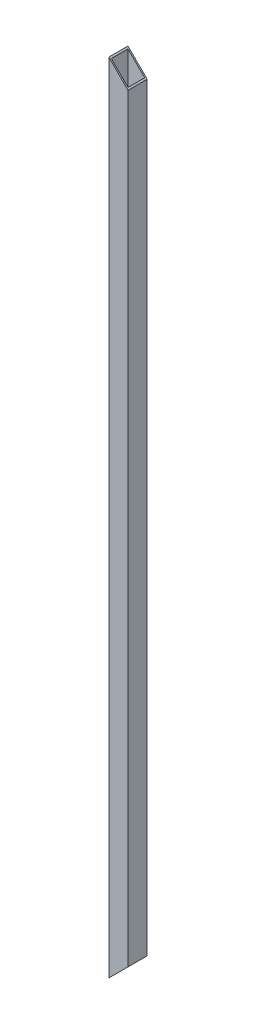
ISO-10303-21;
HEADER;
FILE_DESCRIPTION(('STEP AP214'),'2;1');
FILE_NAME('part.step','',(''),(''),'','','');
FILE_SCHEMA(('AUTOMOTIVE_DESIGN { 1 0 10303 214 1 1 1 1 }'));
ENDSEC;
DATA;
#1=APPLICATION_CONTEXT('core data for automotive mechanical design processes');
#2=APPLICATION_PROTOCOL_DEFINITION('international standard','automotive_design',2000,#1);
#3=PRODUCT_CONTEXT('',#1,'mechanical');
#4=PRODUCT('Part','Part','',(#3));
#5=PRODUCT_RELATED_PRODUCT_CATEGORY('part','',(#4));
#6=PRODUCT_DEFINITION_FORMATION('','',#4);
#7=PRODUCT_DEFINITION_CONTEXT('part definition',#1,'design');
#8=PRODUCT_DEFINITION('design','',#6,#7);
#9=PRODUCT_DEFINITION_SHAPE('','',#8);
#10=(LENGTH_UNIT() NAMED_UNIT(*) SI_UNIT(.MILLI.,.METRE.));
#11=(NAMED_UNIT(*) PLANE_ANGLE_UNIT() SI_UNIT($,.RADIAN.));
#12=(NAMED_UNIT(*) SI_UNIT($,.STERADIAN.) SOLID_ANGLE_UNIT());
#13=UNCERTAINTY_MEASURE_WITH_UNIT(LENGTH_MEASURE(1.E-05),#10,'distance_accuracy_value','');
#14=(GEOMETRIC_REPRESENTATION_CONTEXT(3) GLOBAL_UNCERTAINTY_ASSIGNED_CONTEXT((#13)) GLOBAL_UNIT_ASSIGNED_CONTEXT((#10,
#11,#12)) REPRESENTATION_CONTEXT('',''));
#15=CARTESIAN_POINT('',(0.,0.,0.));
#16=DIRECTION('',(0.,0.,1.));
#17=DIRECTION('',(1.,0.,0.));
#18=AXIS2_PLACEMENT_3D('',#15,#16,#17);
#19=CARTESIAN_POINT('',(19.,1580.,-19.));
#20=DIRECTION('',(1.,0.,0.));
#21=DIRECTION('',(0.,0.,-1.));
#22=AXIS2_PLACEMENT_3D('',#19,#20,#21);
#23=PLANE('',#22);
#24=DIRECTION('',(0.,0.,1.));
#25=VECTOR('',#24,1.);
#26=CARTESIAN_POINT('',(19.,1542.,-1561.91365988153));
#27=LINE('',#26,#25);
#28=CARTESIAN_POINT('',(19.,1542.,-19.));
#29=VERTEX_POINT('',#28);
#30=CARTESIAN_POINT('',(19.,1542.,19.));
#31=VERTEX_POINT('',#30);
#32=EDGE_CURVE('E97',#29,#31,#27,.T.);
#33=ORIENTED_EDGE('',*,*,#32,.T.);
#34=DIRECTION('',(0.,-1.,0.));
#35=VECTOR('',#34,1.);
#36=CARTESIAN_POINT('',(19.,1580.,19.));
#37=LINE('',#36,#35);
#38=CARTESIAN_POINT('',(19.,38.,19.));
#39=VERTEX_POINT('',#38);
#40=EDGE_CURVE('E95',#31,#39,#37,.T.);
#41=ORIENTED_EDGE('',*,*,#40,.T.);
#42=DIRECTION('',(0.,0.,1.));
#43=VECTOR('',#42,1.);
#44=CARTESIAN_POINT('',(19.,38.,-1561.91365988153));
#45=LINE('',#44,#43);
#46=CARTESIAN_POINT('',(19.,38.0000000000005,-19.));
#47=VERTEX_POINT('',#46);
#48=EDGE_CURVE('E137',#47,#39,#45,.T.);
#49=ORIENTED_EDGE('',*,*,#48,.F.);
#50=DIRECTION('',(0.,-1.,0.));
#51=VECTOR('',#50,1.);
#52=CARTESIAN_POINT('',(19.,1580.,-19.));
#53=LINE('',#52,#51);
#54=EDGE_CURVE('E85',#29,#47,#53,.T.);
#55=ORIENTED_EDGE('',*,*,#54,.F.);
#56=EDGE_LOOP('',(#33,#41,#49,#55));
#57=FACE_BOUND('',#56,.T.);
#58=ADVANCED_FACE('F17',(#57),#23,.T.);
#59=CARTESIAN_POINT('',(19.,1580.,19.));
#60=DIRECTION('',(0.,0.,1.));
#61=DIRECTION('',(1.,0.,0.));
#62=AXIS2_PLACEMENT_3D('',#59,#60,#61);
#63=PLANE('',#62);
#64=DIRECTION('',(0.707106781186547,-0.707106781186548,0.));
#65=VECTOR('',#64,1.);
#66=CARTESIAN_POINT('',(-19.,1580.,19.));
#67=LINE('',#66,#65);
#68=CARTESIAN_POINT('',(-19.,1580.,19.));
#69=VERTEX_POINT('',#68);
#70=EDGE_CURVE('E31',#69,#31,#67,.T.);
#71=ORIENTED_EDGE('',*,*,#70,.F.);
#72=DIRECTION('',(0.,-1.,0.));
#73=VECTOR('',#72,1.);
#74=CARTESIAN_POINT('',(-19.,1580.,19.));
#75=LINE('',#74,#73);
#76=CARTESIAN_POINT('',(-19.,0.,19.));
#77=VERTEX_POINT('',#76);
#78=EDGE_CURVE('E93',#69,#77,#75,.T.);
#79=ORIENTED_EDGE('',*,*,#78,.T.);
#80=DIRECTION('',(0.707106781186547,0.707106781186548,0.));
#81=VECTOR('',#80,1.);
#82=CARTESIAN_POINT('',(-19.,0.,19.));
#83=LINE('',#82,#81);
#84=EDGE_CURVE('E134',#77,#39,#83,.T.);
#85=ORIENTED_EDGE('',*,*,#84,.T.);
#86=ORIENTED_EDGE('',*,*,#40,.F.);
#87=EDGE_LOOP('',(#71,#79,#85,#86));
#88=FACE_BOUND('',#87,.T.);
#89=ADVANCED_FACE('F91',(#88),#63,.T.);
#90=CARTESIAN_POINT('',(-19.,1580.,-19.));
#91=DIRECTION('',(0.,0.,-1.));
#92=DIRECTION('',(-1.,0.,0.));
#93=AXIS2_PLACEMENT_3D('',#90,#91,#92);
#94=PLANE('',#93);
#95=DIRECTION('',(-0.707106781186547,0.707106781186548,0.));
#96=VECTOR('',#95,1.);
#97=CARTESIAN_POINT('',(-19.,1580.,-19.));
#98=LINE('',#97,#96);
#99=CARTESIAN_POINT('',(-19.,1580.,-19.));
#100=VERTEX_POINT('',#99);
#101=EDGE_CURVE('E80',#29,#100,#98,.T.);
#102=ORIENTED_EDGE('',*,*,#101,.F.);
#103=ORIENTED_EDGE('',*,*,#54,.T.);
#104=DIRECTION('',(-0.707106781186547,-0.707106781186548,0.));
#105=VECTOR('',#104,1.);
#106=CARTESIAN_POINT('',(771.,790.,-19.));
#107=LINE('',#106,#105);
#108=CARTESIAN_POINT('',(-19.,0.,-19.));
#109=VERTEX_POINT('',#108);
#110=EDGE_CURVE('E145',#47,#109,#107,.T.);
#111=ORIENTED_EDGE('',*,*,#110,.T.);
#112=DIRECTION('',(0.,-1.,0.));
#113=VECTOR('',#112,1.);
#114=CARTESIAN_POINT('',(-19.,1580.,-19.));
#115=LINE('',#114,#113);
#116=EDGE_CURVE('E100',#100,#109,#115,.T.);
#117=ORIENTED_EDGE('',*,*,#116,.F.);
#118=EDGE_LOOP('',(#102,#103,#111,#117));
#119=FACE_BOUND('',#118,.T.);
#120=ADVANCED_FACE('F152',(#119),#94,.T.);
#121=CARTESIAN_POINT('',(-19.,1580.,19.));
#122=DIRECTION('',(-1.,0.,0.));
#123=DIRECTION('',(0.,0.,1.));
#124=AXIS2_PLACEMENT_3D('',#121,#122,#123);
#125=PLANE('',#124);
#126=DIRECTION('',(0.,0.,-1.));
#127=VECTOR('',#126,1.);
#128=CARTESIAN_POINT('',(-19.,0.,19.));
#129=LINE('',#128,#127);
#130=EDGE_CURVE('E86',#77,#109,#129,.T.);
#131=ORIENTED_EDGE('',*,*,#130,.F.);
#132=ORIENTED_EDGE('',*,*,#78,.F.);
#133=DIRECTION('',(0.,0.,-1.));
#134=VECTOR('',#133,1.);
#135=CARTESIAN_POINT('',(-19.,1580.,19.));
#136=LINE('',#135,#134);
#137=EDGE_CURVE('E77',#69,#100,#136,.T.);
#138=ORIENTED_EDGE('',*,*,#137,.T.);
#139=ORIENTED_EDGE('',*,*,#116,.T.);
#140=EDGE_LOOP('',(#131,#132,#138,#139));
#141=FACE_BOUND('',#140,.T.);
#142=ADVANCED_FACE('F99',(#141),#125,.T.);
#143=CARTESIAN_POINT('',(-19.,0.,-1561.91365988153));
#144=DIRECTION('',(0.707106781186548,-0.707106781186547,0.));
#145=DIRECTION('',(0.707106781186547,0.707106781186548,0.));
#146=AXIS2_PLACEMENT_3D('',#143,#144,#145);
#147=PLANE('',#146);
#148=DIRECTION('',(0.707106781186547,0.707106781186548,0.));
#149=VECTOR('',#148,1.);
#150=CARTESIAN_POINT('',(-19.,0.,-16.5));
#151=LINE('',#150,#149);
#152=CARTESIAN_POINT('',(-16.5,2.5,-16.5));
#153=VERTEX_POINT('',#152);
#154=CARTESIAN_POINT('',(16.5,35.5,-16.5));
#155=VERTEX_POINT('',#154);
#156=EDGE_CURVE('E24',#153,#155,#151,.T.);
#157=ORIENTED_EDGE('',*,*,#156,.F.);
#158=DIRECTION('',(0.,0.,-1.));
#159=VECTOR('',#158,1.);
#160=CARTESIAN_POINT('',(-16.5,2.5,-1561.91365988153));
#161=LINE('',#160,#159);
#162=CARTESIAN_POINT('',(-16.5,2.49999999999994,16.5));
#163=VERTEX_POINT('',#162);
#164=EDGE_CURVE('E102',#163,#153,#161,.T.);
#165=ORIENTED_EDGE('',*,*,#164,.F.);
#166=DIRECTION('',(-0.707106781186547,-0.707106781186548,0.));
#167=VECTOR('',#166,1.);
#168=CARTESIAN_POINT('',(-19.,0.,16.5));
#169=LINE('',#168,#167);
#170=CARTESIAN_POINT('',(16.5,35.5,16.5));
#171=VERTEX_POINT('',#170);
#172=EDGE_CURVE('E109',#171,#163,#169,.T.);
#173=ORIENTED_EDGE('',*,*,#172,.F.);
#174=DIRECTION('',(0.,0.,1.));
#175=VECTOR('',#174,1.);
#176=CARTESIAN_POINT('',(16.5,35.5,-1561.91365988153));
#177=LINE('',#176,#175);
#178=EDGE_CURVE('E112',#155,#171,#177,.T.);
#179=ORIENTED_EDGE('',*,*,#178,.F.);
#180=EDGE_LOOP('',(#157,#165,#173,#179));
#181=FACE_BOUND('',#180,.T.);
#182=ORIENTED_EDGE('',*,*,#48,.T.);
#183=ORIENTED_EDGE('',*,*,#84,.F.);
#184=ORIENTED_EDGE('',*,*,#130,.T.);
#185=ORIENTED_EDGE('',*,*,#110,.F.);
#186=EDGE_LOOP('',(#182,#183,#184,#185));
#187=FACE_BOUND('',#186,.T.);
#188=ADVANCED_FACE('F126',(#181,#187),#147,.T.);
#189=CARTESIAN_POINT('',(-16.5,1580.91365988153,-16.5));
#190=DIRECTION('',(0.,0.,-1.));
#191=DIRECTION('',(-1.,0.,0.));
#192=AXIS2_PLACEMENT_3D('',#189,#190,#191);
#193=PLANE('',#192);
#194=DIRECTION('',(0.,-1.,0.));
#195=VECTOR('',#194,1.);
#196=CARTESIAN_POINT('',(16.5,1580.91365988153,-16.5));
#197=LINE('',#196,#195);
#198=CARTESIAN_POINT('',(16.5,1544.5,-16.5));
#199=VERTEX_POINT('',#198);
#200=EDGE_CURVE('E120',#199,#155,#197,.T.);
#201=ORIENTED_EDGE('',*,*,#200,.F.);
#202=DIRECTION('',(-0.707106781186547,0.707106781186548,0.));
#203=VECTOR('',#202,1.);
#204=CARTESIAN_POINT('',(-18.2068299407628,1579.20682994077,-16.5));
#205=LINE('',#204,#203);
#206=CARTESIAN_POINT('',(-16.5,1577.5,-16.5));
#207=VERTEX_POINT('',#206);
#208=EDGE_CURVE('E161',#199,#207,#205,.T.);
#209=ORIENTED_EDGE('',*,*,#208,.T.);
#210=DIRECTION('',(0.,-1.,0.));
#211=VECTOR('',#210,1.);
#212=CARTESIAN_POINT('',(-16.5,1580.91365988153,-16.5));
#213=LINE('',#212,#211);
#214=EDGE_CURVE('E122',#207,#153,#213,.T.);
#215=ORIENTED_EDGE('',*,*,#214,.T.);
#216=ORIENTED_EDGE('',*,*,#156,.T.);
#217=EDGE_LOOP('',(#201,#209,#215,#216));
#218=FACE_BOUND('',#217,.T.);
#219=ADVANCED_FACE('F119',(#218),#193,.F.);
#220=CARTESIAN_POINT('',(16.5,1580.91365988153,-16.5));
#221=DIRECTION('',(1.,0.,0.));
#222=DIRECTION('',(0.,0.,-1.));
#223=AXIS2_PLACEMENT_3D('',#220,#221,#222);
#224=PLANE('',#223);
#225=DIRECTION('',(0.,-1.,0.));
#226=VECTOR('',#225,1.);
#227=CARTESIAN_POINT('',(16.5,1580.91365988153,16.5));
#228=LINE('',#227,#226);
#229=CARTESIAN_POINT('',(16.5,1544.5,16.5));
#230=VERTEX_POINT('',#229);
#231=EDGE_CURVE('E132',#230,#171,#228,.T.);
#232=ORIENTED_EDGE('',*,*,#231,.F.);
#233=DIRECTION('',(0.,0.,-1.));
#234=VECTOR('',#233,1.);
#235=CARTESIAN_POINT('',(16.5,1544.5,-16.5));
#236=LINE('',#235,#234);
#237=EDGE_CURVE('E133',#230,#199,#236,.T.);
#238=ORIENTED_EDGE('',*,*,#237,.T.);
#239=ORIENTED_EDGE('',*,*,#200,.T.);
#240=ORIENTED_EDGE('',*,*,#178,.T.);
#241=EDGE_LOOP('',(#232,#238,#239,#240));
#242=FACE_BOUND('',#241,.T.);
#243=ADVANCED_FACE('F130',(#242),#224,.F.);
#244=CARTESIAN_POINT('',(16.5,1580.91365988153,16.5));
#245=DIRECTION('',(0.,0.,1.));
#246=DIRECTION('',(1.,0.,0.));
#247=AXIS2_PLACEMENT_3D('',#244,#245,#246);
#248=PLANE('',#247);
#249=DIRECTION('',(0.,-1.,0.));
#250=VECTOR('',#249,1.);
#251=CARTESIAN_POINT('',(-16.5,1580.91365988153,16.5));
#252=LINE('',#251,#250);
#253=CARTESIAN_POINT('',(-16.5,1577.5,16.5));
#254=VERTEX_POINT('',#253);
#255=EDGE_CURVE('E139',#254,#163,#252,.T.);
#256=ORIENTED_EDGE('',*,*,#255,.F.);
#257=DIRECTION('',(0.707106781186547,-0.707106781186548,0.));
#258=VECTOR('',#257,1.);
#259=CARTESIAN_POINT('',(-1.70682994076281,1562.70682994076,16.5));
#260=LINE('',#259,#258);
#261=EDGE_CURVE('E155',#254,#230,#260,.T.);
#262=ORIENTED_EDGE('',*,*,#261,.T.);
#263=ORIENTED_EDGE('',*,*,#231,.T.);
#264=ORIENTED_EDGE('',*,*,#172,.T.);
#265=EDGE_LOOP('',(#256,#262,#263,#264));
#266=FACE_BOUND('',#265,.T.);
#267=ADVANCED_FACE('F168',(#266),#248,.F.);
#268=CARTESIAN_POINT('',(-16.5,1580.91365988153,16.5));
#269=DIRECTION('',(-1.,0.,0.));
#270=DIRECTION('',(0.,0.,1.));
#271=AXIS2_PLACEMENT_3D('',#268,#269,#270);
#272=PLANE('',#271);
#273=ORIENTED_EDGE('',*,*,#214,.F.);
#274=DIRECTION('',(0.,0.,1.));
#275=VECTOR('',#274,1.);
#276=CARTESIAN_POINT('',(-16.5,1577.5,16.5));
#277=LINE('',#276,#275);
#278=EDGE_CURVE('E11',#207,#254,#277,.T.);
#279=ORIENTED_EDGE('',*,*,#278,.T.);
#280=ORIENTED_EDGE('',*,*,#255,.T.);
#281=ORIENTED_EDGE('',*,*,#164,.T.);
#282=EDGE_LOOP('',(#273,#279,#280,#281));
#283=FACE_BOUND('',#282,.T.);
#284=ADVANCED_FACE('F166',(#283),#272,.F.);
#285=CARTESIAN_POINT('',(-19.,1580.,-1561.91365988153));
#286=DIRECTION('',(-0.707106781186548,-0.707106781186547,0.));
#287=DIRECTION('',(0.707106781186547,-0.707106781186548,0.));
#288=AXIS2_PLACEMENT_3D('',#285,#286,#287);
#289=PLANE('',#288);
#290=ORIENTED_EDGE('',*,*,#237,.F.);
#291=ORIENTED_EDGE('',*,*,#261,.F.);
#292=ORIENTED_EDGE('',*,*,#278,.F.);
#293=ORIENTED_EDGE('',*,*,#208,.F.);
#294=EDGE_LOOP('',(#290,#291,#292,#293));
#295=FACE_BOUND('',#294,.T.);
#296=ORIENTED_EDGE('',*,*,#101,.T.);
#297=ORIENTED_EDGE('',*,*,#137,.F.);
#298=ORIENTED_EDGE('',*,*,#70,.T.);
#299=ORIENTED_EDGE('',*,*,#32,.F.);
#300=EDGE_LOOP('',(#296,#297,#298,#299));
#301=FACE_BOUND('',#300,.T.);
#302=ADVANCED_FACE('F78',(#295,#301),#289,.F.);
#303=CLOSED_SHELL('',(#58,#89,#120,#142,#188,#219,#243,#267,#284,#302));
#304=MANIFOLD_SOLID_BREP('B1',#303);
#305=ADVANCED_BREP_SHAPE_REPRESENTATION('',(#18,#304),#14);
#306=SHAPE_DEFINITION_REPRESENTATION(#9,#305);
ENDSEC;
END-ISO-10303-21;
